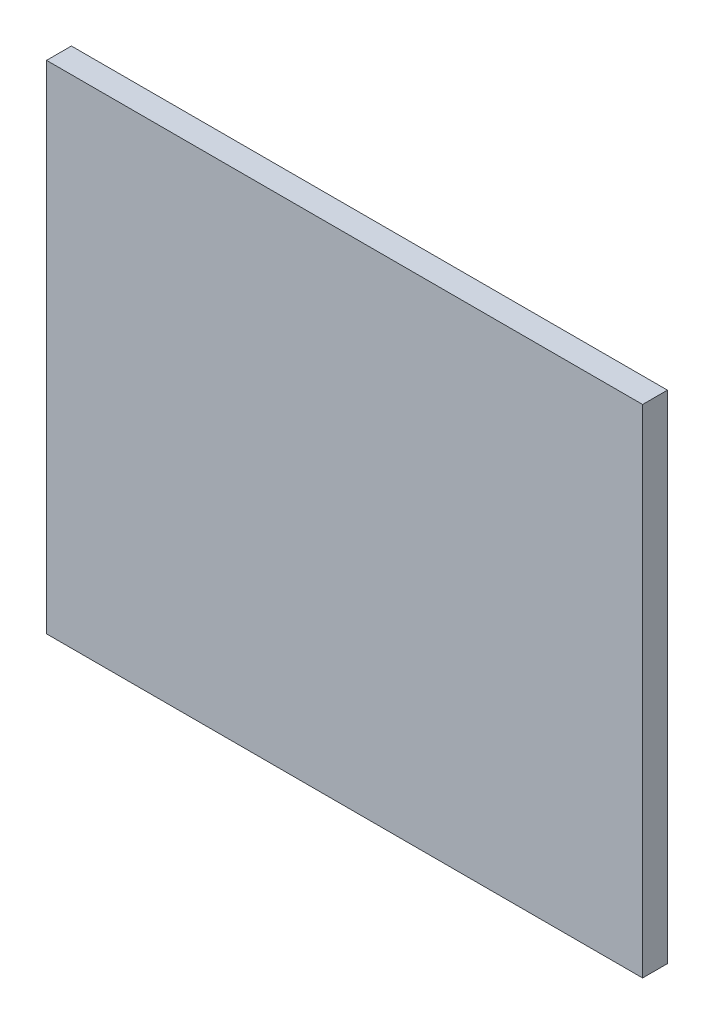
ISO-10303-21;
HEADER;
FILE_DESCRIPTION(('STEP AP214'),'2;1');
FILE_NAME('part.step','',(''),(''),'','','');
FILE_SCHEMA(('AUTOMOTIVE_DESIGN { 1 0 10303 214 1 1 1 1 }'));
ENDSEC;
DATA;
#1=APPLICATION_CONTEXT('core data for automotive mechanical design processes');
#2=APPLICATION_PROTOCOL_DEFINITION('international standard','automotive_design',2000,#1);
#3=PRODUCT_CONTEXT('',#1,'mechanical');
#4=PRODUCT('Part','Part','',(#3));
#5=PRODUCT_RELATED_PRODUCT_CATEGORY('part','',(#4));
#6=PRODUCT_DEFINITION_FORMATION('','',#4);
#7=PRODUCT_DEFINITION_CONTEXT('part definition',#1,'design');
#8=PRODUCT_DEFINITION('design','',#6,#7);
#9=PRODUCT_DEFINITION_SHAPE('','',#8);
#10=(LENGTH_UNIT() NAMED_UNIT(*) SI_UNIT(.MILLI.,.METRE.));
#11=(NAMED_UNIT(*) PLANE_ANGLE_UNIT() SI_UNIT($,.RADIAN.));
#12=(NAMED_UNIT(*) SI_UNIT($,.STERADIAN.) SOLID_ANGLE_UNIT());
#13=UNCERTAINTY_MEASURE_WITH_UNIT(LENGTH_MEASURE(1.E-05),#10,'distance_accuracy_value','');
#14=(GEOMETRIC_REPRESENTATION_CONTEXT(3) GLOBAL_UNCERTAINTY_ASSIGNED_CONTEXT((#13)) GLOBAL_UNIT_ASSIGNED_CONTEXT((#10,
#11,#12)) REPRESENTATION_CONTEXT('',''));
#15=CARTESIAN_POINT('',(0.,0.,0.));
#16=DIRECTION('',(0.,0.,1.));
#17=DIRECTION('',(1.,0.,0.));
#18=AXIS2_PLACEMENT_3D('',#15,#16,#17);
#19=CARTESIAN_POINT('',(0.775000000002183,0.25,-1.10578646929991E-10));
#20=DIRECTION('',(0.,1.,0.));
#21=DIRECTION('',(-1.,0.,2.91047741463046E-11));
#22=AXIS2_PLACEMENT_3D('',#19,#20,#21);
#23=PLANE('',#22);
#24=DIRECTION('',(-1.,0.,2.91047741463046E-11));
#25=VECTOR('',#24,1.);
#26=CARTESIAN_POINT('',(0.775000000002183,0.25,-1.10578646929991E-10));
#27=LINE('',#26,#25);
#28=CARTESIAN_POINT('',(0.775000000002183,0.25,-1.10578646929991E-10));
#29=VERTEX_POINT('',#28);
#30=CARTESIAN_POINT('',(0.175000000002183,0.25,-9.31157824422087E-11));
#31=VERTEX_POINT('',#30);
#32=EDGE_CURVE('E11',#29,#31,#27,.T.);
#33=ORIENTED_EDGE('',*,*,#32,.T.);
#34=DIRECTION('',(2.91044965905485E-11,0.,1.));
#35=VECTOR('',#34,1.);
#36=CARTESIAN_POINT('',(0.175000000002183,0.25,-9.31157824422087E-11));
#37=LINE('',#36,#35);
#38=CARTESIAN_POINT('',(0.175000000002911,0.25,0.0249999999068842));
#39=VERTEX_POINT('',#38);
#40=EDGE_CURVE('E24',#31,#39,#37,.T.);
#41=ORIENTED_EDGE('',*,*,#40,.T.);
#42=DIRECTION('',(-1.,0.,2.91047741463046E-11));
#43=VECTOR('',#42,1.);
#44=CARTESIAN_POINT('',(0.77500000000291,0.25,0.0249999998894214));
#45=LINE('',#44,#43);
#46=CARTESIAN_POINT('',(0.77500000000291,0.25,0.0249999998894214));
#47=VERTEX_POINT('',#46);
#48=EDGE_CURVE('E75',#47,#39,#45,.T.);
#49=ORIENTED_EDGE('',*,*,#48,.F.);
#50=DIRECTION('',(2.91044965905485E-11,0.,1.));
#51=VECTOR('',#50,1.);
#52=CARTESIAN_POINT('',(0.775000000002183,0.25,-1.10578646929991E-10));
#53=LINE('',#52,#51);
#54=EDGE_CURVE('E86',#29,#47,#53,.T.);
#55=ORIENTED_EDGE('',*,*,#54,.F.);
#56=EDGE_LOOP('',(#33,#41,#49,#55));
#57=FACE_BOUND('',#56,.T.);
#58=ADVANCED_FACE('F17',(#57),#23,.T.);
#59=CARTESIAN_POINT('',(0.775000000002183,-0.25,-1.10578646929991E-10));
#60=DIRECTION('',(1.,0.,-2.91044965905485E-11));
#61=DIRECTION('',(0.,1.,0.));
#62=AXIS2_PLACEMENT_3D('',#59,#60,#61);
#63=PLANE('',#62);
#64=DIRECTION('',(0.,1.,0.));
#65=VECTOR('',#64,1.);
#66=CARTESIAN_POINT('',(0.775000000002183,-0.25,-1.10578646929991E-10));
#67=LINE('',#66,#65);
#68=CARTESIAN_POINT('',(0.775000000002183,-0.25,-1.10578646929991E-10));
#69=VERTEX_POINT('',#68);
#70=EDGE_CURVE('E83',#69,#29,#67,.T.);
#71=ORIENTED_EDGE('',*,*,#70,.T.);
#72=ORIENTED_EDGE('',*,*,#54,.T.);
#73=DIRECTION('',(0.,1.,0.));
#74=VECTOR('',#73,1.);
#75=CARTESIAN_POINT('',(0.775000000002911,-0.25,0.0249999998894214));
#76=LINE('',#75,#74);
#77=CARTESIAN_POINT('',(0.775000000002911,-0.25,0.0249999998894214));
#78=VERTEX_POINT('',#77);
#79=EDGE_CURVE('E81',#78,#47,#76,.T.);
#80=ORIENTED_EDGE('',*,*,#79,.F.);
#81=DIRECTION('',(2.91044965905485E-11,0.,1.));
#82=VECTOR('',#81,1.);
#83=CARTESIAN_POINT('',(0.775000000002183,-0.25,-1.10578646929991E-10));
#84=LINE('',#83,#82);
#85=EDGE_CURVE('E61',#69,#78,#84,.T.);
#86=ORIENTED_EDGE('',*,*,#85,.F.);
#87=EDGE_LOOP('',(#71,#72,#80,#86));
#88=FACE_BOUND('',#87,.T.);
#89=ADVANCED_FACE('F91',(#88),#63,.T.);
#90=CARTESIAN_POINT('',(0.175000000002183,-0.25,-9.31157824422087E-11));
#91=DIRECTION('',(0.,-1.,0.));
#92=DIRECTION('',(1.,0.,-2.91047741463046E-11));
#93=AXIS2_PLACEMENT_3D('',#90,#91,#92);
#94=PLANE('',#93);
#95=DIRECTION('',(1.,0.,-2.91047741463046E-11));
#96=VECTOR('',#95,1.);
#97=CARTESIAN_POINT('',(0.175000000002183,-0.25,-9.31157824422087E-11));
#98=LINE('',#97,#96);
#99=CARTESIAN_POINT('',(0.175000000002183,-0.25,-9.31157824422087E-11));
#100=VERTEX_POINT('',#99);
#101=EDGE_CURVE('E65',#100,#69,#98,.T.);
#102=ORIENTED_EDGE('',*,*,#101,.T.);
#103=ORIENTED_EDGE('',*,*,#85,.T.);
#104=DIRECTION('',(1.,0.,-2.91047741463046E-11));
#105=VECTOR('',#104,1.);
#106=CARTESIAN_POINT('',(0.175000000002911,-0.25,0.0249999999068842));
#107=LINE('',#106,#105);
#108=CARTESIAN_POINT('',(0.175000000002911,-0.25,0.0249999999068842));
#109=VERTEX_POINT('',#108);
#110=EDGE_CURVE('E54',#109,#78,#107,.T.);
#111=ORIENTED_EDGE('',*,*,#110,.F.);
#112=DIRECTION('',(2.91044965905485E-11,0.,1.));
#113=VECTOR('',#112,1.);
#114=CARTESIAN_POINT('',(0.175000000002183,-0.25,-9.31157824422087E-11));
#115=LINE('',#114,#113);
#116=EDGE_CURVE('E58',#100,#109,#115,.T.);
#117=ORIENTED_EDGE('',*,*,#116,.F.);
#118=EDGE_LOOP('',(#102,#103,#111,#117));
#119=FACE_BOUND('',#118,.T.);
#120=ADVANCED_FACE('F57',(#119),#94,.T.);
#121=CARTESIAN_POINT('',(0.175000000002183,0.25,-9.31157824422087E-11));
#122=DIRECTION('',(-1.,0.,2.91044965905485E-11));
#123=DIRECTION('',(0.,-1.,0.));
#124=AXIS2_PLACEMENT_3D('',#121,#122,#123);
#125=PLANE('',#124);
#126=DIRECTION('',(0.,-1.,0.));
#127=VECTOR('',#126,1.);
#128=CARTESIAN_POINT('',(0.175000000002183,0.15,-9.31157824422087E-11));
#129=LINE('',#128,#127);
#130=EDGE_CURVE('E71',#31,#100,#129,.T.);
#131=ORIENTED_EDGE('',*,*,#130,.T.);
#132=ORIENTED_EDGE('',*,*,#116,.T.);
#133=DIRECTION('',(0.,-1.,0.));
#134=VECTOR('',#133,1.);
#135=CARTESIAN_POINT('',(0.175000000002911,0.15,0.0249999999068842));
#136=LINE('',#135,#134);
#137=EDGE_CURVE('E70',#39,#109,#136,.T.);
#138=ORIENTED_EDGE('',*,*,#137,.F.);
#139=ORIENTED_EDGE('',*,*,#40,.F.);
#140=EDGE_LOOP('',(#131,#132,#138,#139));
#141=FACE_BOUND('',#140,.T.);
#142=ADVANCED_FACE('F69',(#141),#125,.T.);
#143=CARTESIAN_POINT('',(0.47500000000291,0.,0.0249999998981529));
#144=DIRECTION('',(2.91044965905485E-11,0.,1.));
#145=DIRECTION('',(1.,0.,-2.91044965905485E-11));
#146=AXIS2_PLACEMENT_3D('',#143,#144,#145);
#147=PLANE('',#146);
#148=ORIENTED_EDGE('',*,*,#137,.T.);
#149=ORIENTED_EDGE('',*,*,#110,.T.);
#150=ORIENTED_EDGE('',*,*,#79,.T.);
#151=ORIENTED_EDGE('',*,*,#48,.T.);
#152=EDGE_LOOP('',(#148,#149,#150,#151));
#153=FACE_BOUND('',#152,.T.);
#154=ADVANCED_FACE('F74',(#153),#147,.T.);
#155=CARTESIAN_POINT('',(0.475000000002183,0.,-1.018472146861E-10));
#156=DIRECTION('',(2.91047741463046E-11,0.,1.));
#157=DIRECTION('',(1.,0.,-2.91047741463046E-11));
#158=AXIS2_PLACEMENT_3D('',#155,#156,#157);
#159=PLANE('',#158);
#160=ORIENTED_EDGE('',*,*,#130,.F.);
#161=ORIENTED_EDGE('',*,*,#32,.F.);
#162=ORIENTED_EDGE('',*,*,#70,.F.);
#163=ORIENTED_EDGE('',*,*,#101,.F.);
#164=EDGE_LOOP('',(#160,#161,#162,#163));
#165=FACE_BOUND('',#164,.T.);
#166=ADVANCED_FACE('F89',(#165),#159,.F.);
#167=CLOSED_SHELL('',(#58,#89,#120,#142,#154,#166));
#168=MANIFOLD_SOLID_BREP('B1',#167);
#169=ADVANCED_BREP_SHAPE_REPRESENTATION('',(#18,#168),#14);
#170=SHAPE_DEFINITION_REPRESENTATION(#9,#169);
ENDSEC;
END-ISO-10303-21;
